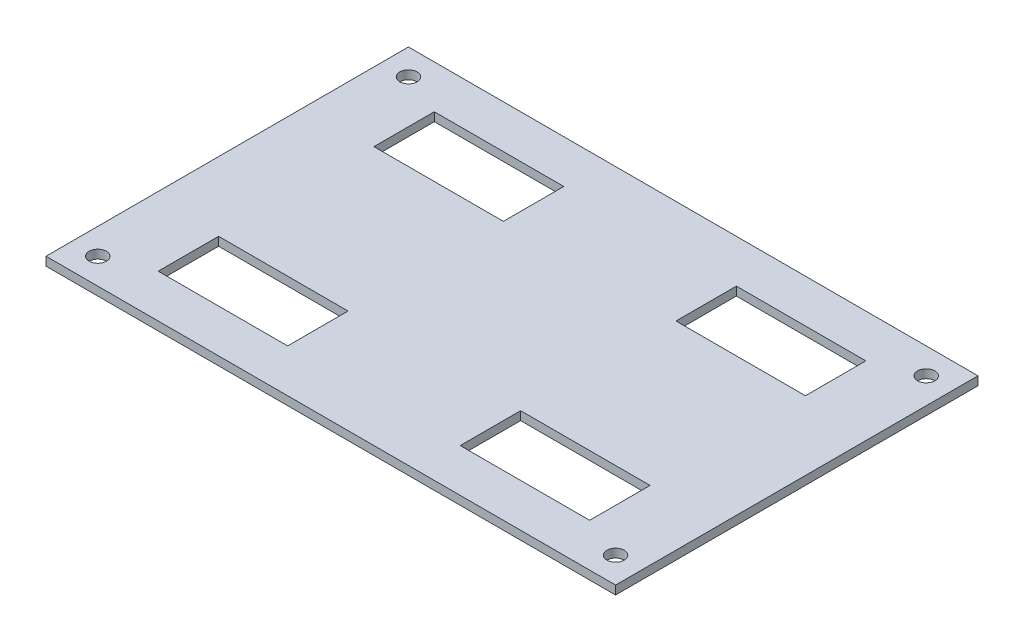
ISO-10303-21;
HEADER;
FILE_DESCRIPTION(('STEP AP214'),'2;1');
FILE_NAME('part.step','',(''),(''),'','','');
FILE_SCHEMA(('AUTOMOTIVE_DESIGN { 1 0 10303 214 1 1 1 1 }'));
ENDSEC;
DATA;
#1=APPLICATION_CONTEXT('core data for automotive mechanical design processes');
#2=APPLICATION_PROTOCOL_DEFINITION('international standard','automotive_design',2000,#1);
#3=PRODUCT_CONTEXT('',#1,'mechanical');
#4=PRODUCT('Part','Part','',(#3));
#5=PRODUCT_RELATED_PRODUCT_CATEGORY('part','',(#4));
#6=PRODUCT_DEFINITION_FORMATION('','',#4);
#7=PRODUCT_DEFINITION_CONTEXT('part definition',#1,'design');
#8=PRODUCT_DEFINITION('design','',#6,#7);
#9=PRODUCT_DEFINITION_SHAPE('','',#8);
#10=(LENGTH_UNIT() NAMED_UNIT(*) SI_UNIT(.MILLI.,.METRE.));
#11=(NAMED_UNIT(*) PLANE_ANGLE_UNIT() SI_UNIT($,.RADIAN.));
#12=(NAMED_UNIT(*) SI_UNIT($,.STERADIAN.) SOLID_ANGLE_UNIT());
#13=UNCERTAINTY_MEASURE_WITH_UNIT(LENGTH_MEASURE(1.E-05),#10,'distance_accuracy_value','');
#14=(GEOMETRIC_REPRESENTATION_CONTEXT(3) GLOBAL_UNCERTAINTY_ASSIGNED_CONTEXT((#13)) GLOBAL_UNIT_ASSIGNED_CONTEXT((#10,
#11,#12)) REPRESENTATION_CONTEXT('',''));
#15=CARTESIAN_POINT('',(0.,0.,0.));
#16=DIRECTION('',(0.,0.,1.));
#17=DIRECTION('',(1.,0.,0.));
#18=AXIS2_PLACEMENT_3D('',#15,#16,#17);
#19=CARTESIAN_POINT('',(0.,1.,0.));
#20=DIRECTION('',(0.,-1.,0.));
#21=DIRECTION('',(0.,0.,-1.));
#22=AXIS2_PLACEMENT_3D('',#19,#20,#21);
#23=PLANE('',#22);
#24=DIRECTION('',(0.,0.,1.));
#25=VECTOR('',#24,1.);
#26=CARTESIAN_POINT('',(10.,1.,-16.));
#27=LINE('',#26,#25);
#28=CARTESIAN_POINT('',(10.,1.,-16.));
#29=VERTEX_POINT('',#28);
#30=CARTESIAN_POINT('',(10.,1.,-9.00000000000001));
#31=VERTEX_POINT('',#30);
#32=EDGE_CURVE('E212',#29,#31,#27,.T.);
#33=ORIENTED_EDGE('',*,*,#32,.F.);
#34=DIRECTION('',(-1.,0.,0.));
#35=VECTOR('',#34,1.);
#36=CARTESIAN_POINT('',(10.,1.,-16.));
#37=LINE('',#36,#35);
#38=CARTESIAN_POINT('',(25.,1.,-16.));
#39=VERTEX_POINT('',#38);
#40=EDGE_CURVE('E220',#39,#29,#37,.T.);
#41=ORIENTED_EDGE('',*,*,#40,.F.);
#42=DIRECTION('',(0.,0.,-1.));
#43=VECTOR('',#42,1.);
#44=CARTESIAN_POINT('',(25.,1.,-16.));
#45=LINE('',#44,#43);
#46=CARTESIAN_POINT('',(25.,1.,-9.00000000000001));
#47=VERTEX_POINT('',#46);
#48=EDGE_CURVE('E217',#47,#39,#45,.T.);
#49=ORIENTED_EDGE('',*,*,#48,.F.);
#50=DIRECTION('',(1.,0.,0.));
#51=VECTOR('',#50,1.);
#52=CARTESIAN_POINT('',(10.,1.,-9.00000000000001));
#53=LINE('',#52,#51);
#54=EDGE_CURVE('E214',#31,#47,#53,.T.);
#55=ORIENTED_EDGE('',*,*,#54,.F.);
#56=EDGE_LOOP('',(#33,#41,#49,#55));
#57=FACE_BOUND('',#56,.T.);
#58=DIRECTION('',(0.,0.,1.));
#59=VECTOR('',#58,1.);
#60=CARTESIAN_POINT('',(10.,1.,9.));
#61=LINE('',#60,#59);
#62=CARTESIAN_POINT('',(10.,1.,9.));
#63=VERTEX_POINT('',#62);
#64=CARTESIAN_POINT('',(10.,1.,16.));
#65=VERTEX_POINT('',#64);
#66=EDGE_CURVE('E274',#63,#65,#61,.T.);
#67=ORIENTED_EDGE('',*,*,#66,.F.);
#68=DIRECTION('',(-1.,0.,0.));
#69=VECTOR('',#68,1.);
#70=CARTESIAN_POINT('',(10.,1.,9.));
#71=LINE('',#70,#69);
#72=CARTESIAN_POINT('',(25.,1.,9.));
#73=VERTEX_POINT('',#72);
#74=EDGE_CURVE('E282',#73,#63,#71,.T.);
#75=ORIENTED_EDGE('',*,*,#74,.F.);
#76=DIRECTION('',(0.,0.,-1.));
#77=VECTOR('',#76,1.);
#78=CARTESIAN_POINT('',(25.,1.,9.));
#79=LINE('',#78,#77);
#80=CARTESIAN_POINT('',(25.,1.,16.));
#81=VERTEX_POINT('',#80);
#82=EDGE_CURVE('E279',#81,#73,#79,.T.);
#83=ORIENTED_EDGE('',*,*,#82,.F.);
#84=DIRECTION('',(1.,0.,0.));
#85=VECTOR('',#84,1.);
#86=CARTESIAN_POINT('',(10.,1.,16.));
#87=LINE('',#86,#85);
#88=EDGE_CURVE('E276',#65,#81,#87,.T.);
#89=ORIENTED_EDGE('',*,*,#88,.F.);
#90=EDGE_LOOP('',(#67,#75,#83,#89));
#91=FACE_BOUND('',#90,.T.);
#92=DIRECTION('',(0.,0.,1.));
#93=VECTOR('',#92,1.);
#94=CARTESIAN_POINT('',(-33.,1.,21.));
#95=LINE('',#94,#93);
#96=CARTESIAN_POINT('',(-33.,1.,-21.));
#97=VERTEX_POINT('',#96);
#98=CARTESIAN_POINT('',(-33.,1.,21.));
#99=VERTEX_POINT('',#98);
#100=EDGE_CURVE('E329',#97,#99,#95,.T.);
#101=ORIENTED_EDGE('',*,*,#100,.T.);
#102=DIRECTION('',(1.,0.,0.));
#103=VECTOR('',#102,1.);
#104=CARTESIAN_POINT('',(-33.,1.,21.));
#105=LINE('',#104,#103);
#106=CARTESIAN_POINT('',(33.,1.,21.));
#107=VERTEX_POINT('',#106);
#108=EDGE_CURVE('E332',#99,#107,#105,.T.);
#109=ORIENTED_EDGE('',*,*,#108,.T.);
#110=DIRECTION('',(0.,0.,-1.));
#111=VECTOR('',#110,1.);
#112=CARTESIAN_POINT('',(33.,1.,21.));
#113=LINE('',#112,#111);
#114=CARTESIAN_POINT('',(33.,1.,-21.));
#115=VERTEX_POINT('',#114);
#116=EDGE_CURVE('E335',#107,#115,#113,.T.);
#117=ORIENTED_EDGE('',*,*,#116,.T.);
#118=DIRECTION('',(-1.,0.,0.));
#119=VECTOR('',#118,1.);
#120=CARTESIAN_POINT('',(-33.,1.,-21.));
#121=LINE('',#120,#119);
#122=EDGE_CURVE('E337',#115,#97,#121,.T.);
#123=ORIENTED_EDGE('',*,*,#122,.T.);
#124=EDGE_LOOP('',(#101,#109,#117,#123));
#125=FACE_BOUND('',#124,.T.);
#126=CARTESIAN_POINT('',(-30.,1.,18.));
#127=DIRECTION('',(0.,1.,0.));
#128=DIRECTION('',(0.,0.,1.));
#129=AXIS2_PLACEMENT_3D('',#126,#127,#128);
#130=CIRCLE('',#129,1.);
#131=CARTESIAN_POINT('',(-30.,1.,19.));
#132=VERTEX_POINT('',#131);
#133=EDGE_CURVE('E323',#132,#132,#130,.T.);
#134=ORIENTED_EDGE('',*,*,#133,.F.);
#135=EDGE_LOOP('',(#134));
#136=FACE_BOUND('',#135,.T.);
#137=CARTESIAN_POINT('',(30.,1.,18.));
#138=DIRECTION('',(0.,1.,0.));
#139=DIRECTION('',(0.,0.,1.));
#140=AXIS2_PLACEMENT_3D('',#137,#138,#139);
#141=CIRCLE('',#140,0.999999999999998);
#142=CARTESIAN_POINT('',(30.,1.,19.));
#143=VERTEX_POINT('',#142);
#144=EDGE_CURVE('E317',#143,#143,#141,.T.);
#145=ORIENTED_EDGE('',*,*,#144,.F.);
#146=EDGE_LOOP('',(#145));
#147=FACE_BOUND('',#146,.T.);
#148=CARTESIAN_POINT('',(30.,1.,-18.));
#149=DIRECTION('',(0.,1.,0.));
#150=DIRECTION('',(0.,0.,1.));
#151=AXIS2_PLACEMENT_3D('',#148,#149,#150);
#152=CIRCLE('',#151,0.999999999999998);
#153=CARTESIAN_POINT('',(30.,1.,-17.));
#154=VERTEX_POINT('',#153);
#155=EDGE_CURVE('E311',#154,#154,#152,.T.);
#156=ORIENTED_EDGE('',*,*,#155,.F.);
#157=EDGE_LOOP('',(#156));
#158=FACE_BOUND('',#157,.T.);
#159=CARTESIAN_POINT('',(-30.,1.,-18.));
#160=DIRECTION('',(0.,1.,0.));
#161=DIRECTION('',(0.,0.,1.));
#162=AXIS2_PLACEMENT_3D('',#159,#160,#161);
#163=CIRCLE('',#162,1.);
#164=CARTESIAN_POINT('',(-30.,1.,-17.));
#165=VERTEX_POINT('',#164);
#166=EDGE_CURVE('E305',#165,#165,#163,.T.);
#167=ORIENTED_EDGE('',*,*,#166,.F.);
#168=EDGE_LOOP('',(#167));
#169=FACE_BOUND('',#168,.T.);
#170=DIRECTION('',(0.,0.,1.));
#171=VECTOR('',#170,1.);
#172=CARTESIAN_POINT('',(-25.,1.,16.));
#173=LINE('',#172,#171);
#174=CARTESIAN_POINT('',(-25.,1.,9.));
#175=VERTEX_POINT('',#174);
#176=CARTESIAN_POINT('',(-25.,1.,16.));
#177=VERTEX_POINT('',#176);
#178=EDGE_CURVE('E243',#175,#177,#173,.T.);
#179=ORIENTED_EDGE('',*,*,#178,.F.);
#180=DIRECTION('',(-1.,0.,0.));
#181=VECTOR('',#180,1.);
#182=CARTESIAN_POINT('',(-25.,1.,9.));
#183=LINE('',#182,#181);
#184=CARTESIAN_POINT('',(-10.,1.,9.));
#185=VERTEX_POINT('',#184);
#186=EDGE_CURVE('E251',#185,#175,#183,.T.);
#187=ORIENTED_EDGE('',*,*,#186,.F.);
#188=DIRECTION('',(0.,0.,-1.));
#189=VECTOR('',#188,1.);
#190=CARTESIAN_POINT('',(-10.,1.,16.));
#191=LINE('',#190,#189);
#192=CARTESIAN_POINT('',(-10.,1.,16.));
#193=VERTEX_POINT('',#192);
#194=EDGE_CURVE('E248',#193,#185,#191,.T.);
#195=ORIENTED_EDGE('',*,*,#194,.F.);
#196=DIRECTION('',(1.,0.,0.));
#197=VECTOR('',#196,1.);
#198=CARTESIAN_POINT('',(-25.,1.,16.));
#199=LINE('',#198,#197);
#200=EDGE_CURVE('E245',#177,#193,#199,.T.);
#201=ORIENTED_EDGE('',*,*,#200,.F.);
#202=EDGE_LOOP('',(#179,#187,#195,#201));
#203=FACE_BOUND('',#202,.T.);
#204=DIRECTION('',(0.,0.,-1.));
#205=VECTOR('',#204,1.);
#206=CARTESIAN_POINT('',(-10.,1.,-9.00000000000001));
#207=LINE('',#206,#205);
#208=CARTESIAN_POINT('',(-10.,1.,-9.00000000000001));
#209=VERTEX_POINT('',#208);
#210=CARTESIAN_POINT('',(-10.,1.,-16.));
#211=VERTEX_POINT('',#210);
#212=EDGE_CURVE('E176',#209,#211,#207,.T.);
#213=ORIENTED_EDGE('',*,*,#212,.F.);
#214=DIRECTION('',(1.,0.,0.));
#215=VECTOR('',#214,1.);
#216=CARTESIAN_POINT('',(-10.,1.,-9.00000000000001));
#217=LINE('',#216,#215);
#218=CARTESIAN_POINT('',(-25.,1.,-9.));
#219=VERTEX_POINT('',#218);
#220=EDGE_CURVE('E198',#219,#209,#217,.T.);
#221=ORIENTED_EDGE('',*,*,#220,.F.);
#222=DIRECTION('',(0.,0.,1.));
#223=VECTOR('',#222,1.);
#224=CARTESIAN_POINT('',(-25.,1.,-9.));
#225=LINE('',#224,#223);
#226=CARTESIAN_POINT('',(-25.,1.,-16.));
#227=VERTEX_POINT('',#226);
#228=EDGE_CURVE('E196',#227,#219,#225,.T.);
#229=ORIENTED_EDGE('',*,*,#228,.F.);
#230=DIRECTION('',(-1.,0.,0.));
#231=VECTOR('',#230,1.);
#232=CARTESIAN_POINT('',(-10.,1.,-16.));
#233=LINE('',#232,#231);
#234=EDGE_CURVE('E184',#211,#227,#233,.T.);
#235=ORIENTED_EDGE('',*,*,#234,.F.);
#236=EDGE_LOOP('',(#213,#221,#229,#235));
#237=FACE_BOUND('',#236,.T.);
#238=ADVANCED_FACE('F39',(#57,#91,#125,#136,#147,#158,#169,#203,#237),#23,.F.);
#239=CARTESIAN_POINT('',(0.,0.,0.));
#240=DIRECTION('',(0.,-1.,0.));
#241=DIRECTION('',(0.,0.,-1.));
#242=AXIS2_PLACEMENT_3D('',#239,#240,#241);
#243=PLANE('',#242);
#244=CARTESIAN_POINT('',(30.,0.,-18.));
#245=DIRECTION('',(0.,1.,0.));
#246=DIRECTION('',(0.,0.,1.));
#247=AXIS2_PLACEMENT_3D('',#244,#245,#246);
#248=CIRCLE('',#247,0.999999999999998);
#249=CARTESIAN_POINT('',(30.,0.,-17.));
#250=VERTEX_POINT('',#249);
#251=EDGE_CURVE('E308',#250,#250,#248,.T.);
#252=ORIENTED_EDGE('',*,*,#251,.T.);
#253=EDGE_LOOP('',(#252));
#254=FACE_BOUND('',#253,.T.);
#255=CARTESIAN_POINT('',(-30.,0.,18.));
#256=DIRECTION('',(0.,1.,0.));
#257=DIRECTION('',(0.,0.,1.));
#258=AXIS2_PLACEMENT_3D('',#255,#256,#257);
#259=CIRCLE('',#258,1.);
#260=CARTESIAN_POINT('',(-30.,0.,19.));
#261=VERTEX_POINT('',#260);
#262=EDGE_CURVE('E320',#261,#261,#259,.T.);
#263=ORIENTED_EDGE('',*,*,#262,.T.);
#264=EDGE_LOOP('',(#263));
#265=FACE_BOUND('',#264,.T.);
#266=DIRECTION('',(0.,0.,1.));
#267=VECTOR('',#266,1.);
#268=CARTESIAN_POINT('',(-33.,0.,21.));
#269=LINE('',#268,#267);
#270=CARTESIAN_POINT('',(-33.,0.,-21.));
#271=VERTEX_POINT('',#270);
#272=CARTESIAN_POINT('',(-33.,0.,21.));
#273=VERTEX_POINT('',#272);
#274=EDGE_CURVE('E326',#271,#273,#269,.T.);
#275=ORIENTED_EDGE('',*,*,#274,.F.);
#276=DIRECTION('',(-1.,0.,0.));
#277=VECTOR('',#276,1.);
#278=CARTESIAN_POINT('',(-33.,0.,-21.));
#279=LINE('',#278,#277);
#280=CARTESIAN_POINT('',(33.,0.,-21.));
#281=VERTEX_POINT('',#280);
#282=EDGE_CURVE('E333',#281,#271,#279,.T.);
#283=ORIENTED_EDGE('',*,*,#282,.F.);
#284=DIRECTION('',(0.,0.,-1.));
#285=VECTOR('',#284,1.);
#286=CARTESIAN_POINT('',(33.,0.,21.));
#287=LINE('',#286,#285);
#288=CARTESIAN_POINT('',(33.,0.,21.));
#289=VERTEX_POINT('',#288);
#290=EDGE_CURVE('E344',#289,#281,#287,.T.);
#291=ORIENTED_EDGE('',*,*,#290,.F.);
#292=DIRECTION('',(1.,0.,0.));
#293=VECTOR('',#292,1.);
#294=CARTESIAN_POINT('',(-33.,0.,21.));
#295=LINE('',#294,#293);
#296=EDGE_CURVE('E342',#273,#289,#295,.T.);
#297=ORIENTED_EDGE('',*,*,#296,.F.);
#298=EDGE_LOOP('',(#275,#283,#291,#297));
#299=FACE_BOUND('',#298,.T.);
#300=CARTESIAN_POINT('',(30.,0.,18.));
#301=DIRECTION('',(0.,1.,0.));
#302=DIRECTION('',(0.,0.,1.));
#303=AXIS2_PLACEMENT_3D('',#300,#301,#302);
#304=CIRCLE('',#303,0.999999999999998);
#305=CARTESIAN_POINT('',(30.,0.,19.));
#306=VERTEX_POINT('',#305);
#307=EDGE_CURVE('E314',#306,#306,#304,.T.);
#308=ORIENTED_EDGE('',*,*,#307,.T.);
#309=EDGE_LOOP('',(#308));
#310=FACE_BOUND('',#309,.T.);
#311=CARTESIAN_POINT('',(-30.,0.,-18.));
#312=DIRECTION('',(0.,1.,0.));
#313=DIRECTION('',(0.,0.,1.));
#314=AXIS2_PLACEMENT_3D('',#311,#312,#313);
#315=CIRCLE('',#314,1.);
#316=CARTESIAN_POINT('',(-30.,0.,-17.));
#317=VERTEX_POINT('',#316);
#318=EDGE_CURVE('E304',#317,#317,#315,.T.);
#319=ORIENTED_EDGE('',*,*,#318,.T.);
#320=EDGE_LOOP('',(#319));
#321=FACE_BOUND('',#320,.T.);
#322=DIRECTION('',(-1.,0.,0.));
#323=VECTOR('',#322,1.);
#324=CARTESIAN_POINT('',(10.,0.,9.));
#325=LINE('',#324,#323);
#326=CARTESIAN_POINT('',(25.,0.,9.));
#327=VERTEX_POINT('',#326);
#328=CARTESIAN_POINT('',(10.,0.,9.));
#329=VERTEX_POINT('',#328);
#330=EDGE_CURVE('E277',#327,#329,#325,.T.);
#331=ORIENTED_EDGE('',*,*,#330,.T.);
#332=DIRECTION('',(0.,0.,1.));
#333=VECTOR('',#332,1.);
#334=CARTESIAN_POINT('',(10.,0.,9.));
#335=LINE('',#334,#333);
#336=CARTESIAN_POINT('',(10.,0.,16.));
#337=VERTEX_POINT('',#336);
#338=EDGE_CURVE('E273',#329,#337,#335,.T.);
#339=ORIENTED_EDGE('',*,*,#338,.T.);
#340=DIRECTION('',(1.,0.,0.));
#341=VECTOR('',#340,1.);
#342=CARTESIAN_POINT('',(10.,0.,16.));
#343=LINE('',#342,#341);
#344=CARTESIAN_POINT('',(25.,0.,16.));
#345=VERTEX_POINT('',#344);
#346=EDGE_CURVE('E287',#337,#345,#343,.T.);
#347=ORIENTED_EDGE('',*,*,#346,.T.);
#348=DIRECTION('',(0.,0.,-1.));
#349=VECTOR('',#348,1.);
#350=CARTESIAN_POINT('',(25.,0.,9.));
#351=LINE('',#350,#349);
#352=EDGE_CURVE('E290',#345,#327,#351,.T.);
#353=ORIENTED_EDGE('',*,*,#352,.T.);
#354=EDGE_LOOP('',(#331,#339,#347,#353));
#355=FACE_BOUND('',#354,.T.);
#356=DIRECTION('',(-1.,0.,0.));
#357=VECTOR('',#356,1.);
#358=CARTESIAN_POINT('',(-25.,0.,9.));
#359=LINE('',#358,#357);
#360=CARTESIAN_POINT('',(-10.,0.,9.));
#361=VERTEX_POINT('',#360);
#362=CARTESIAN_POINT('',(-25.,0.,9.));
#363=VERTEX_POINT('',#362);
#364=EDGE_CURVE('E246',#361,#363,#359,.T.);
#365=ORIENTED_EDGE('',*,*,#364,.T.);
#366=DIRECTION('',(0.,0.,1.));
#367=VECTOR('',#366,1.);
#368=CARTESIAN_POINT('',(-25.,0.,16.));
#369=LINE('',#368,#367);
#370=CARTESIAN_POINT('',(-25.,0.,16.));
#371=VERTEX_POINT('',#370);
#372=EDGE_CURVE('E242',#363,#371,#369,.T.);
#373=ORIENTED_EDGE('',*,*,#372,.T.);
#374=DIRECTION('',(1.,0.,0.));
#375=VECTOR('',#374,1.);
#376=CARTESIAN_POINT('',(-25.,0.,16.));
#377=LINE('',#376,#375);
#378=CARTESIAN_POINT('',(-10.,0.,16.));
#379=VERTEX_POINT('',#378);
#380=EDGE_CURVE('E256',#371,#379,#377,.T.);
#381=ORIENTED_EDGE('',*,*,#380,.T.);
#382=DIRECTION('',(0.,0.,-1.));
#383=VECTOR('',#382,1.);
#384=CARTESIAN_POINT('',(-10.,0.,16.));
#385=LINE('',#384,#383);
#386=EDGE_CURVE('E259',#379,#361,#385,.T.);
#387=ORIENTED_EDGE('',*,*,#386,.T.);
#388=EDGE_LOOP('',(#365,#373,#381,#387));
#389=FACE_BOUND('',#388,.T.);
#390=DIRECTION('',(-1.,0.,0.));
#391=VECTOR('',#390,1.);
#392=CARTESIAN_POINT('',(10.,0.,-16.));
#393=LINE('',#392,#391);
#394=CARTESIAN_POINT('',(25.,0.,-16.));
#395=VERTEX_POINT('',#394);
#396=CARTESIAN_POINT('',(10.,0.,-16.));
#397=VERTEX_POINT('',#396);
#398=EDGE_CURVE('E215',#395,#397,#393,.T.);
#399=ORIENTED_EDGE('',*,*,#398,.T.);
#400=DIRECTION('',(0.,0.,1.));
#401=VECTOR('',#400,1.);
#402=CARTESIAN_POINT('',(10.,0.,-16.));
#403=LINE('',#402,#401);
#404=CARTESIAN_POINT('',(10.,0.,-9.00000000000001));
#405=VERTEX_POINT('',#404);
#406=EDGE_CURVE('E192',#397,#405,#403,.T.);
#407=ORIENTED_EDGE('',*,*,#406,.T.);
#408=DIRECTION('',(1.,0.,0.));
#409=VECTOR('',#408,1.);
#410=CARTESIAN_POINT('',(10.,0.,-9.00000000000001));
#411=LINE('',#410,#409);
#412=CARTESIAN_POINT('',(25.,0.,-9.00000000000001));
#413=VERTEX_POINT('',#412);
#414=EDGE_CURVE('E225',#405,#413,#411,.T.);
#415=ORIENTED_EDGE('',*,*,#414,.T.);
#416=DIRECTION('',(0.,0.,-1.));
#417=VECTOR('',#416,1.);
#418=CARTESIAN_POINT('',(25.,0.,-16.));
#419=LINE('',#418,#417);
#420=EDGE_CURVE('E228',#413,#395,#419,.T.);
#421=ORIENTED_EDGE('',*,*,#420,.T.);
#422=EDGE_LOOP('',(#399,#407,#415,#421));
#423=FACE_BOUND('',#422,.T.);
#424=DIRECTION('',(1.,0.,0.));
#425=VECTOR('',#424,1.);
#426=CARTESIAN_POINT('',(-10.,0.,-9.00000000000001));
#427=LINE('',#426,#425);
#428=CARTESIAN_POINT('',(-25.,0.,-9.));
#429=VERTEX_POINT('',#428);
#430=CARTESIAN_POINT('',(-10.,0.,-9.00000000000001));
#431=VERTEX_POINT('',#430);
#432=EDGE_CURVE('E185',#429,#431,#427,.T.);
#433=ORIENTED_EDGE('',*,*,#432,.T.);
#434=DIRECTION('',(0.,0.,-1.));
#435=VECTOR('',#434,1.);
#436=CARTESIAN_POINT('',(-10.,0.,-9.00000000000001));
#437=LINE('',#436,#435);
#438=CARTESIAN_POINT('',(-10.,0.,-16.));
#439=VERTEX_POINT('',#438);
#440=EDGE_CURVE('E62',#431,#439,#437,.T.);
#441=ORIENTED_EDGE('',*,*,#440,.T.);
#442=DIRECTION('',(-1.,0.,0.));
#443=VECTOR('',#442,1.);
#444=CARTESIAN_POINT('',(-10.,0.,-16.));
#445=LINE('',#444,#443);
#446=CARTESIAN_POINT('',(-25.,0.,-16.));
#447=VERTEX_POINT('',#446);
#448=EDGE_CURVE('E191',#439,#447,#445,.T.);
#449=ORIENTED_EDGE('',*,*,#448,.T.);
#450=DIRECTION('',(0.,0.,1.));
#451=VECTOR('',#450,1.);
#452=CARTESIAN_POINT('',(-25.,0.,-9.));
#453=LINE('',#452,#451);
#454=EDGE_CURVE('E204',#447,#429,#453,.T.);
#455=ORIENTED_EDGE('',*,*,#454,.T.);
#456=EDGE_LOOP('',(#433,#441,#449,#455));
#457=FACE_BOUND('',#456,.T.);
#458=ADVANCED_FACE('F362',(#254,#265,#299,#310,#321,#355,#389,#423,#457),#243,.T.);
#459=CARTESIAN_POINT('',(-33.,1.,21.));
#460=DIRECTION('',(1.,0.,0.));
#461=DIRECTION('',(0.,0.,-1.));
#462=AXIS2_PLACEMENT_3D('',#459,#460,#461);
#463=PLANE('',#462);
#464=ORIENTED_EDGE('',*,*,#274,.T.);
#465=DIRECTION('',(0.,-1.,0.));
#466=VECTOR('',#465,1.);
#467=CARTESIAN_POINT('',(-33.,1.,21.));
#468=LINE('',#467,#466);
#469=EDGE_CURVE('E11',#99,#273,#468,.T.);
#470=ORIENTED_EDGE('',*,*,#469,.F.);
#471=ORIENTED_EDGE('',*,*,#100,.F.);
#472=DIRECTION('',(0.,-1.,0.));
#473=VECTOR('',#472,1.);
#474=CARTESIAN_POINT('',(-33.,1.,-21.));
#475=LINE('',#474,#473);
#476=EDGE_CURVE('E339',#97,#271,#475,.T.);
#477=ORIENTED_EDGE('',*,*,#476,.T.);
#478=EDGE_LOOP('',(#464,#470,#471,#477));
#479=FACE_BOUND('',#478,.T.);
#480=ADVANCED_FACE('F41',(#479),#463,.F.);
#481=CARTESIAN_POINT('',(-33.,1.,21.));
#482=DIRECTION('',(0.,0.,-1.));
#483=DIRECTION('',(-1.,0.,0.));
#484=AXIS2_PLACEMENT_3D('',#481,#482,#483);
#485=PLANE('',#484);
#486=ORIENTED_EDGE('',*,*,#296,.T.);
#487=DIRECTION('',(0.,-1.,0.));
#488=VECTOR('',#487,1.);
#489=CARTESIAN_POINT('',(33.,1.,21.));
#490=LINE('',#489,#488);
#491=EDGE_CURVE('E47',#107,#289,#490,.T.);
#492=ORIENTED_EDGE('',*,*,#491,.F.);
#493=ORIENTED_EDGE('',*,*,#108,.F.);
#494=ORIENTED_EDGE('',*,*,#469,.T.);
#495=EDGE_LOOP('',(#486,#492,#493,#494));
#496=FACE_BOUND('',#495,.T.);
#497=ADVANCED_FACE('F373',(#496),#485,.F.);
#498=CARTESIAN_POINT('',(33.,1.,21.));
#499=DIRECTION('',(-1.,0.,0.));
#500=DIRECTION('',(0.,0.,1.));
#501=AXIS2_PLACEMENT_3D('',#498,#499,#500);
#502=PLANE('',#501);
#503=ORIENTED_EDGE('',*,*,#290,.T.);
#504=DIRECTION('',(0.,-1.,0.));
#505=VECTOR('',#504,1.);
#506=CARTESIAN_POINT('',(33.,1.,-21.));
#507=LINE('',#506,#505);
#508=EDGE_CURVE('E349',#115,#281,#507,.T.);
#509=ORIENTED_EDGE('',*,*,#508,.F.);
#510=ORIENTED_EDGE('',*,*,#116,.F.);
#511=ORIENTED_EDGE('',*,*,#491,.T.);
#512=EDGE_LOOP('',(#503,#509,#510,#511));
#513=FACE_BOUND('',#512,.T.);
#514=ADVANCED_FACE('F356',(#513),#502,.F.);
#515=CARTESIAN_POINT('',(-33.,1.,-21.));
#516=DIRECTION('',(0.,0.,1.));
#517=DIRECTION('',(1.,0.,0.));
#518=AXIS2_PLACEMENT_3D('',#515,#516,#517);
#519=PLANE('',#518);
#520=ORIENTED_EDGE('',*,*,#282,.T.);
#521=ORIENTED_EDGE('',*,*,#476,.F.);
#522=ORIENTED_EDGE('',*,*,#122,.F.);
#523=ORIENTED_EDGE('',*,*,#508,.T.);
#524=EDGE_LOOP('',(#520,#521,#522,#523));
#525=FACE_BOUND('',#524,.T.);
#526=ADVANCED_FACE('F366',(#525),#519,.F.);
#527=CARTESIAN_POINT('',(-30.,1.,18.));
#528=DIRECTION('',(0.,-1.,0.));
#529=DIRECTION('',(0.,0.,-1.));
#530=AXIS2_PLACEMENT_3D('',#527,#528,#529);
#531=CYLINDRICAL_SURFACE('',#530,1.);
#532=ORIENTED_EDGE('',*,*,#133,.T.);
#533=EDGE_LOOP('',(#532));
#534=FACE_BOUND('',#533,.T.);
#535=ORIENTED_EDGE('',*,*,#262,.F.);
#536=EDGE_LOOP('',(#535));
#537=FACE_BOUND('',#536,.T.);
#538=ADVANCED_FACE('F391',(#534,#537),#531,.F.);
#539=CARTESIAN_POINT('',(30.,1.,18.));
#540=DIRECTION('',(0.,-1.,0.));
#541=DIRECTION('',(0.,0.,-1.));
#542=AXIS2_PLACEMENT_3D('',#539,#540,#541);
#543=CYLINDRICAL_SURFACE('',#542,0.999999999999998);
#544=ORIENTED_EDGE('',*,*,#144,.T.);
#545=EDGE_LOOP('',(#544));
#546=FACE_BOUND('',#545,.T.);
#547=ORIENTED_EDGE('',*,*,#307,.F.);
#548=EDGE_LOOP('',(#547));
#549=FACE_BOUND('',#548,.T.);
#550=ADVANCED_FACE('F398',(#546,#549),#543,.F.);
#551=CARTESIAN_POINT('',(30.,1.,-18.));
#552=DIRECTION('',(0.,-1.,0.));
#553=DIRECTION('',(0.,0.,-1.));
#554=AXIS2_PLACEMENT_3D('',#551,#552,#553);
#555=CYLINDRICAL_SURFACE('',#554,0.999999999999998);
#556=ORIENTED_EDGE('',*,*,#155,.T.);
#557=EDGE_LOOP('',(#556));
#558=FACE_BOUND('',#557,.T.);
#559=ORIENTED_EDGE('',*,*,#251,.F.);
#560=EDGE_LOOP('',(#559));
#561=FACE_BOUND('',#560,.T.);
#562=ADVANCED_FACE('F403',(#558,#561),#555,.F.);
#563=CARTESIAN_POINT('',(-30.,1.,-18.));
#564=DIRECTION('',(0.,-1.,0.));
#565=DIRECTION('',(0.,0.,-1.));
#566=AXIS2_PLACEMENT_3D('',#563,#564,#565);
#567=CYLINDRICAL_SURFACE('',#566,1.);
#568=ORIENTED_EDGE('',*,*,#166,.T.);
#569=EDGE_LOOP('',(#568));
#570=FACE_BOUND('',#569,.T.);
#571=ORIENTED_EDGE('',*,*,#318,.F.);
#572=EDGE_LOOP('',(#571));
#573=FACE_BOUND('',#572,.T.);
#574=ADVANCED_FACE('F463',(#570,#573),#567,.F.);
#575=CARTESIAN_POINT('',(10.,1.,9.));
#576=DIRECTION('',(1.,0.,0.));
#577=DIRECTION('',(0.,0.,-1.));
#578=AXIS2_PLACEMENT_3D('',#575,#576,#577);
#579=PLANE('',#578);
#580=ORIENTED_EDGE('',*,*,#338,.F.);
#581=DIRECTION('',(0.,-1.,0.));
#582=VECTOR('',#581,1.);
#583=CARTESIAN_POINT('',(10.,1.,9.));
#584=LINE('',#583,#582);
#585=EDGE_CURVE('E284',#63,#329,#584,.T.);
#586=ORIENTED_EDGE('',*,*,#585,.F.);
#587=ORIENTED_EDGE('',*,*,#66,.T.);
#588=DIRECTION('',(0.,-1.,0.));
#589=VECTOR('',#588,1.);
#590=CARTESIAN_POINT('',(10.,1.,16.));
#591=LINE('',#590,#589);
#592=EDGE_CURVE('E301',#65,#337,#591,.T.);
#593=ORIENTED_EDGE('',*,*,#592,.T.);
#594=EDGE_LOOP('',(#580,#586,#587,#593));
#595=FACE_BOUND('',#594,.T.);
#596=ADVANCED_FACE('F459',(#595),#579,.T.);
#597=CARTESIAN_POINT('',(10.,1.,16.));
#598=DIRECTION('',(0.,0.,-1.));
#599=DIRECTION('',(-1.,0.,0.));
#600=AXIS2_PLACEMENT_3D('',#597,#598,#599);
#601=PLANE('',#600);
#602=ORIENTED_EDGE('',*,*,#346,.F.);
#603=ORIENTED_EDGE('',*,*,#592,.F.);
#604=ORIENTED_EDGE('',*,*,#88,.T.);
#605=DIRECTION('',(0.,-1.,0.));
#606=VECTOR('',#605,1.);
#607=CARTESIAN_POINT('',(25.,1.,16.));
#608=LINE('',#607,#606);
#609=EDGE_CURVE('E299',#81,#345,#608,.T.);
#610=ORIENTED_EDGE('',*,*,#609,.T.);
#611=EDGE_LOOP('',(#602,#603,#604,#610));
#612=FACE_BOUND('',#611,.T.);
#613=ADVANCED_FACE('F455',(#612),#601,.T.);
#614=CARTESIAN_POINT('',(25.,1.,9.));
#615=DIRECTION('',(-1.,0.,0.));
#616=DIRECTION('',(0.,0.,1.));
#617=AXIS2_PLACEMENT_3D('',#614,#615,#616);
#618=PLANE('',#617);
#619=ORIENTED_EDGE('',*,*,#352,.F.);
#620=ORIENTED_EDGE('',*,*,#609,.F.);
#621=ORIENTED_EDGE('',*,*,#82,.T.);
#622=DIRECTION('',(0.,-1.,0.));
#623=VECTOR('',#622,1.);
#624=CARTESIAN_POINT('',(25.,1.,9.));
#625=LINE('',#624,#623);
#626=EDGE_CURVE('E297',#73,#327,#625,.T.);
#627=ORIENTED_EDGE('',*,*,#626,.T.);
#628=EDGE_LOOP('',(#619,#620,#621,#627));
#629=FACE_BOUND('',#628,.T.);
#630=ADVANCED_FACE('F451',(#629),#618,.T.);
#631=CARTESIAN_POINT('',(10.,1.,9.));
#632=DIRECTION('',(0.,0.,1.));
#633=DIRECTION('',(1.,0.,0.));
#634=AXIS2_PLACEMENT_3D('',#631,#632,#633);
#635=PLANE('',#634);
#636=ORIENTED_EDGE('',*,*,#330,.F.);
#637=ORIENTED_EDGE('',*,*,#626,.F.);
#638=ORIENTED_EDGE('',*,*,#74,.T.);
#639=ORIENTED_EDGE('',*,*,#585,.T.);
#640=EDGE_LOOP('',(#636,#637,#638,#639));
#641=FACE_BOUND('',#640,.T.);
#642=ADVANCED_FACE('F448',(#641),#635,.T.);
#643=CARTESIAN_POINT('',(-25.,1.,16.));
#644=DIRECTION('',(1.,0.,0.));
#645=DIRECTION('',(0.,0.,-1.));
#646=AXIS2_PLACEMENT_3D('',#643,#644,#645);
#647=PLANE('',#646);
#648=ORIENTED_EDGE('',*,*,#372,.F.);
#649=DIRECTION('',(0.,-1.,0.));
#650=VECTOR('',#649,1.);
#651=CARTESIAN_POINT('',(-25.,1.,9.));
#652=LINE('',#651,#650);
#653=EDGE_CURVE('E253',#175,#363,#652,.T.);
#654=ORIENTED_EDGE('',*,*,#653,.F.);
#655=ORIENTED_EDGE('',*,*,#178,.T.);
#656=DIRECTION('',(0.,-1.,0.));
#657=VECTOR('',#656,1.);
#658=CARTESIAN_POINT('',(-25.,1.,16.));
#659=LINE('',#658,#657);
#660=EDGE_CURVE('E270',#177,#371,#659,.T.);
#661=ORIENTED_EDGE('',*,*,#660,.T.);
#662=EDGE_LOOP('',(#648,#654,#655,#661));
#663=FACE_BOUND('',#662,.T.);
#664=ADVANCED_FACE('F423',(#663),#647,.T.);
#665=CARTESIAN_POINT('',(-25.,1.,16.));
#666=DIRECTION('',(0.,0.,-1.));
#667=DIRECTION('',(-1.,0.,0.));
#668=AXIS2_PLACEMENT_3D('',#665,#666,#667);
#669=PLANE('',#668);
#670=ORIENTED_EDGE('',*,*,#380,.F.);
#671=ORIENTED_EDGE('',*,*,#660,.F.);
#672=ORIENTED_EDGE('',*,*,#200,.T.);
#673=DIRECTION('',(0.,-1.,0.));
#674=VECTOR('',#673,1.);
#675=CARTESIAN_POINT('',(-10.,1.,16.));
#676=LINE('',#675,#674);
#677=EDGE_CURVE('E268',#193,#379,#676,.T.);
#678=ORIENTED_EDGE('',*,*,#677,.T.);
#679=EDGE_LOOP('',(#670,#671,#672,#678));
#680=FACE_BOUND('',#679,.T.);
#681=ADVANCED_FACE('F425',(#680),#669,.T.);
#682=CARTESIAN_POINT('',(-10.,1.,16.));
#683=DIRECTION('',(-1.,0.,0.));
#684=DIRECTION('',(0.,0.,1.));
#685=AXIS2_PLACEMENT_3D('',#682,#683,#684);
#686=PLANE('',#685);
#687=ORIENTED_EDGE('',*,*,#386,.F.);
#688=ORIENTED_EDGE('',*,*,#677,.F.);
#689=ORIENTED_EDGE('',*,*,#194,.T.);
#690=DIRECTION('',(0.,-1.,0.));
#691=VECTOR('',#690,1.);
#692=CARTESIAN_POINT('',(-10.,1.,9.));
#693=LINE('',#692,#691);
#694=EDGE_CURVE('E266',#185,#361,#693,.T.);
#695=ORIENTED_EDGE('',*,*,#694,.T.);
#696=EDGE_LOOP('',(#687,#688,#689,#695));
#697=FACE_BOUND('',#696,.T.);
#698=ADVANCED_FACE('F434',(#697),#686,.T.);
#699=CARTESIAN_POINT('',(-25.,1.,9.));
#700=DIRECTION('',(0.,0.,1.));
#701=DIRECTION('',(1.,0.,0.));
#702=AXIS2_PLACEMENT_3D('',#699,#700,#701);
#703=PLANE('',#702);
#704=ORIENTED_EDGE('',*,*,#364,.F.);
#705=ORIENTED_EDGE('',*,*,#694,.F.);
#706=ORIENTED_EDGE('',*,*,#186,.T.);
#707=ORIENTED_EDGE('',*,*,#653,.T.);
#708=EDGE_LOOP('',(#704,#705,#706,#707));
#709=FACE_BOUND('',#708,.T.);
#710=ADVANCED_FACE('F432',(#709),#703,.T.);
#711=CARTESIAN_POINT('',(10.,1.,-16.));
#712=DIRECTION('',(1.,0.,0.));
#713=DIRECTION('',(0.,0.,-1.));
#714=AXIS2_PLACEMENT_3D('',#711,#712,#713);
#715=PLANE('',#714);
#716=ORIENTED_EDGE('',*,*,#406,.F.);
#717=DIRECTION('',(0.,-1.,0.));
#718=VECTOR('',#717,1.);
#719=CARTESIAN_POINT('',(10.,1.,-16.));
#720=LINE('',#719,#718);
#721=EDGE_CURVE('E222',#29,#397,#720,.T.);
#722=ORIENTED_EDGE('',*,*,#721,.F.);
#723=ORIENTED_EDGE('',*,*,#32,.T.);
#724=DIRECTION('',(0.,-1.,0.));
#725=VECTOR('',#724,1.);
#726=CARTESIAN_POINT('',(10.,1.,-9.00000000000001));
#727=LINE('',#726,#725);
#728=EDGE_CURVE('E239',#31,#405,#727,.T.);
#729=ORIENTED_EDGE('',*,*,#728,.T.);
#730=EDGE_LOOP('',(#716,#722,#723,#729));
#731=FACE_BOUND('',#730,.T.);
#732=ADVANCED_FACE('F441',(#731),#715,.T.);
#733=CARTESIAN_POINT('',(10.,1.,-9.00000000000001));
#734=DIRECTION('',(0.,0.,-1.));
#735=DIRECTION('',(-1.,0.,0.));
#736=AXIS2_PLACEMENT_3D('',#733,#734,#735);
#737=PLANE('',#736);
#738=ORIENTED_EDGE('',*,*,#414,.F.);
#739=ORIENTED_EDGE('',*,*,#728,.F.);
#740=ORIENTED_EDGE('',*,*,#54,.T.);
#741=DIRECTION('',(0.,-1.,0.));
#742=VECTOR('',#741,1.);
#743=CARTESIAN_POINT('',(25.,1.,-9.00000000000001));
#744=LINE('',#743,#742);
#745=EDGE_CURVE('E237',#47,#413,#744,.T.);
#746=ORIENTED_EDGE('',*,*,#745,.T.);
#747=EDGE_LOOP('',(#738,#739,#740,#746));
#748=FACE_BOUND('',#747,.T.);
#749=ADVANCED_FACE('F523',(#748),#737,.T.);
#750=CARTESIAN_POINT('',(25.,1.,-16.));
#751=DIRECTION('',(-1.,0.,0.));
#752=DIRECTION('',(0.,0.,1.));
#753=AXIS2_PLACEMENT_3D('',#750,#751,#752);
#754=PLANE('',#753);
#755=ORIENTED_EDGE('',*,*,#420,.F.);
#756=ORIENTED_EDGE('',*,*,#745,.F.);
#757=ORIENTED_EDGE('',*,*,#48,.T.);
#758=DIRECTION('',(0.,-1.,0.));
#759=VECTOR('',#758,1.);
#760=CARTESIAN_POINT('',(25.,1.,-16.));
#761=LINE('',#760,#759);
#762=EDGE_CURVE('E235',#39,#395,#761,.T.);
#763=ORIENTED_EDGE('',*,*,#762,.T.);
#764=EDGE_LOOP('',(#755,#756,#757,#763));
#765=FACE_BOUND('',#764,.T.);
#766=ADVANCED_FACE('F532',(#765),#754,.T.);
#767=CARTESIAN_POINT('',(10.,1.,-16.));
#768=DIRECTION('',(0.,0.,1.));
#769=DIRECTION('',(1.,0.,0.));
#770=AXIS2_PLACEMENT_3D('',#767,#768,#769);
#771=PLANE('',#770);
#772=ORIENTED_EDGE('',*,*,#398,.F.);
#773=ORIENTED_EDGE('',*,*,#762,.F.);
#774=ORIENTED_EDGE('',*,*,#40,.T.);
#775=ORIENTED_EDGE('',*,*,#721,.T.);
#776=EDGE_LOOP('',(#772,#773,#774,#775));
#777=FACE_BOUND('',#776,.T.);
#778=ADVANCED_FACE('F542',(#777),#771,.T.);
#779=CARTESIAN_POINT('',(-10.,1.,-9.00000000000001));
#780=DIRECTION('',(-1.,0.,0.));
#781=DIRECTION('',(0.,0.,1.));
#782=AXIS2_PLACEMENT_3D('',#779,#780,#781);
#783=PLANE('',#782);
#784=ORIENTED_EDGE('',*,*,#440,.F.);
#785=DIRECTION('',(0.,-1.,0.));
#786=VECTOR('',#785,1.);
#787=CARTESIAN_POINT('',(-10.,1.,-9.00000000000001));
#788=LINE('',#787,#786);
#789=EDGE_CURVE('E180',#209,#431,#788,.T.);
#790=ORIENTED_EDGE('',*,*,#789,.F.);
#791=ORIENTED_EDGE('',*,*,#212,.T.);
#792=DIRECTION('',(0.,-1.,0.));
#793=VECTOR('',#792,1.);
#794=CARTESIAN_POINT('',(-10.,1.,-16.));
#795=LINE('',#794,#793);
#796=EDGE_CURVE('E179',#211,#439,#795,.T.);
#797=ORIENTED_EDGE('',*,*,#796,.T.);
#798=EDGE_LOOP('',(#784,#790,#791,#797));
#799=FACE_BOUND('',#798,.T.);
#800=ADVANCED_FACE('F178',(#799),#783,.T.);
#801=CARTESIAN_POINT('',(-10.,1.,-16.));
#802=DIRECTION('',(0.,0.,1.));
#803=DIRECTION('',(1.,0.,0.));
#804=AXIS2_PLACEMENT_3D('',#801,#802,#803);
#805=PLANE('',#804);
#806=ORIENTED_EDGE('',*,*,#448,.F.);
#807=ORIENTED_EDGE('',*,*,#796,.F.);
#808=ORIENTED_EDGE('',*,*,#234,.T.);
#809=DIRECTION('',(0.,-1.,0.));
#810=VECTOR('',#809,1.);
#811=CARTESIAN_POINT('',(-25.,1.,-16.));
#812=LINE('',#811,#810);
#813=EDGE_CURVE('E193',#227,#447,#812,.T.);
#814=ORIENTED_EDGE('',*,*,#813,.T.);
#815=EDGE_LOOP('',(#806,#807,#808,#814));
#816=FACE_BOUND('',#815,.T.);
#817=ADVANCED_FACE('F188',(#816),#805,.T.);
#818=CARTESIAN_POINT('',(-25.,1.,-9.));
#819=DIRECTION('',(1.,0.,0.));
#820=DIRECTION('',(0.,0.,-1.));
#821=AXIS2_PLACEMENT_3D('',#818,#819,#820);
#822=PLANE('',#821);
#823=ORIENTED_EDGE('',*,*,#454,.F.);
#824=ORIENTED_EDGE('',*,*,#813,.F.);
#825=ORIENTED_EDGE('',*,*,#228,.T.);
#826=DIRECTION('',(0.,-1.,0.));
#827=VECTOR('',#826,1.);
#828=CARTESIAN_POINT('',(-25.,1.,-9.));
#829=LINE('',#828,#827);
#830=EDGE_CURVE('E54',#219,#429,#829,.T.);
#831=ORIENTED_EDGE('',*,*,#830,.T.);
#832=EDGE_LOOP('',(#823,#824,#825,#831));
#833=FACE_BOUND('',#832,.T.);
#834=ADVANCED_FACE('F569',(#833),#822,.T.);
#835=CARTESIAN_POINT('',(-10.,1.,-9.00000000000001));
#836=DIRECTION('',(0.,0.,-1.));
#837=DIRECTION('',(-1.,0.,0.));
#838=AXIS2_PLACEMENT_3D('',#835,#836,#837);
#839=PLANE('',#838);
#840=ORIENTED_EDGE('',*,*,#432,.F.);
#841=ORIENTED_EDGE('',*,*,#830,.F.);
#842=ORIENTED_EDGE('',*,*,#220,.T.);
#843=ORIENTED_EDGE('',*,*,#789,.T.);
#844=EDGE_LOOP('',(#840,#841,#842,#843));
#845=FACE_BOUND('',#844,.T.);
#846=ADVANCED_FACE('F578',(#845),#839,.T.);
#847=CLOSED_SHELL('',(#238,#458,#480,#497,#514,#526,#538,#550,#562,#574,#596,#613,#630,#642,
#664,#681,#698,#710,#732,#749,#766,#778,#800,#817,#834,#846));
#848=MANIFOLD_SOLID_BREP('B2',#847);
#849=ADVANCED_BREP_SHAPE_REPRESENTATION('',(#18,#848),#14);
#850=SHAPE_DEFINITION_REPRESENTATION(#9,#849);
ENDSEC;
END-ISO-10303-21;
